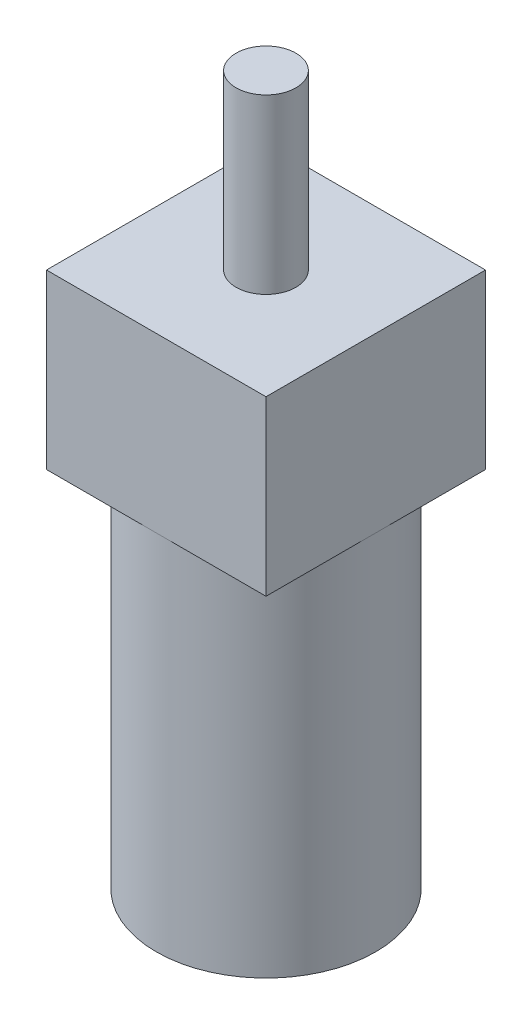
ISO-10303-21;
HEADER;
FILE_DESCRIPTION(('STEP AP214'),'2;1');
FILE_NAME('part.step','',(''),(''),'','','');
FILE_SCHEMA(('AUTOMOTIVE_DESIGN { 1 0 10303 214 1 1 1 1 }'));
ENDSEC;
DATA;
#1=APPLICATION_CONTEXT('core data for automotive mechanical design processes');
#2=APPLICATION_PROTOCOL_DEFINITION('international standard','automotive_design',2000,#1);
#3=PRODUCT_CONTEXT('',#1,'mechanical');
#4=PRODUCT('Part','Part','',(#3));
#5=PRODUCT_RELATED_PRODUCT_CATEGORY('part','',(#4));
#6=PRODUCT_DEFINITION_FORMATION('','',#4);
#7=PRODUCT_DEFINITION_CONTEXT('part definition',#1,'design');
#8=PRODUCT_DEFINITION('design','',#6,#7);
#9=PRODUCT_DEFINITION_SHAPE('','',#8);
#10=(LENGTH_UNIT() NAMED_UNIT(*) SI_UNIT(.MILLI.,.METRE.));
#11=(NAMED_UNIT(*) PLANE_ANGLE_UNIT() SI_UNIT($,.RADIAN.));
#12=(NAMED_UNIT(*) SI_UNIT($,.STERADIAN.) SOLID_ANGLE_UNIT());
#13=UNCERTAINTY_MEASURE_WITH_UNIT(LENGTH_MEASURE(1.E-05),#10,'distance_accuracy_value','');
#14=(GEOMETRIC_REPRESENTATION_CONTEXT(3) GLOBAL_UNCERTAINTY_ASSIGNED_CONTEXT((#13)) GLOBAL_UNIT_ASSIGNED_CONTEXT((#10,
#11,#12)) REPRESENTATION_CONTEXT('',''));
#15=CARTESIAN_POINT('',(0.,0.,0.));
#16=DIRECTION('',(0.,0.,1.));
#17=DIRECTION('',(1.,0.,0.));
#18=AXIS2_PLACEMENT_3D('',#15,#16,#17);
#19=CARTESIAN_POINT('',(0.,10.,0.));
#20=DIRECTION('',(0.,1.,0.));
#21=DIRECTION('',(-1.,0.,0.));
#22=AXIS2_PLACEMENT_3D('',#19,#20,#21);
#23=CYLINDRICAL_SURFACE('',#22,6.05);
#24=CARTESIAN_POINT('',(0.,-10.,0.));
#25=DIRECTION('',(0.,1.,0.));
#26=DIRECTION('',(-1.,0.,0.));
#27=AXIS2_PLACEMENT_3D('',#24,#25,#26);
#28=CIRCLE('',#27,6.05);
#29=CARTESIAN_POINT('',(-6.05,-10.,0.));
#30=VERTEX_POINT('',#29);
#31=EDGE_CURVE('E11',#30,#30,#28,.T.);
#32=ORIENTED_EDGE('',*,*,#31,.T.);
#33=EDGE_LOOP('',(#32));
#34=FACE_BOUND('',#33,.T.);
#35=CARTESIAN_POINT('',(0.,10.,0.));
#36=DIRECTION('',(0.,1.,0.));
#37=DIRECTION('',(-1.,0.,0.));
#38=AXIS2_PLACEMENT_3D('',#35,#36,#37);
#39=CIRCLE('',#38,6.05);
#40=CARTESIAN_POINT('',(-6.05,10.,0.));
#41=VERTEX_POINT('',#40);
#42=CARTESIAN_POINT('',(0.,10.,6.05));
#43=VERTEX_POINT('',#42);
#44=EDGE_CURVE('E42',#41,#43,#39,.T.);
#45=ORIENTED_EDGE('',*,*,#44,.F.);
#46=CARTESIAN_POINT('',(0.,10.,-6.05));
#47=VERTEX_POINT('',#46);
#48=EDGE_CURVE('E49',#47,#41,#39,.T.);
#49=ORIENTED_EDGE('',*,*,#48,.F.);
#50=CARTESIAN_POINT('',(6.04999999999999,10.,0.));
#51=VERTEX_POINT('',#50);
#52=EDGE_CURVE('E53',#51,#47,#39,.T.);
#53=ORIENTED_EDGE('',*,*,#52,.F.);
#54=EDGE_CURVE('E117',#43,#51,#39,.T.);
#55=ORIENTED_EDGE('',*,*,#54,.F.);
#56=EDGE_LOOP('',(#45,#49,#53,#55));
#57=FACE_BOUND('',#56,.T.);
#58=ADVANCED_FACE('F35',(#34,#57),#23,.T.);
#59=CARTESIAN_POINT('',(-6.05,-10.,0.));
#60=DIRECTION('',(0.,-1.,0.));
#61=DIRECTION('',(1.,0.,0.));
#62=AXIS2_PLACEMENT_3D('',#59,#60,#61);
#63=PLANE('',#62);
#64=ORIENTED_EDGE('',*,*,#31,.F.);
#65=EDGE_LOOP('',(#64));
#66=FACE_BOUND('',#65,.T.);
#67=ADVANCED_FACE('F160',(#66),#63,.T.);
#68=CARTESIAN_POINT('',(0.,10.,0.));
#69=DIRECTION('',(0.,1.,0.));
#70=DIRECTION('',(-1.,0.,0.));
#71=AXIS2_PLACEMENT_3D('',#68,#69,#70);
#72=PLANE('',#71);
#73=DIRECTION('',(0.,0.,1.));
#74=VECTOR('',#73,1.);
#75=CARTESIAN_POINT('',(-6.05,10.,6.05));
#76=LINE('',#75,#74);
#77=CARTESIAN_POINT('',(-6.05,10.,6.05));
#78=VERTEX_POINT('',#77);
#79=EDGE_CURVE('E110',#41,#78,#76,.T.);
#80=ORIENTED_EDGE('',*,*,#79,.F.);
#81=ORIENTED_EDGE('',*,*,#44,.T.);
#82=DIRECTION('',(1.,0.,0.));
#83=VECTOR('',#82,1.);
#84=CARTESIAN_POINT('',(6.04999999999999,10.,6.05));
#85=LINE('',#84,#83);
#86=EDGE_CURVE('E149',#78,#43,#85,.T.);
#87=ORIENTED_EDGE('',*,*,#86,.F.);
#88=EDGE_LOOP('',(#80,#81,#87));
#89=FACE_BOUND('',#88,.T.);
#90=ADVANCED_FACE('F154',(#89),#72,.F.);
#91=CARTESIAN_POINT('',(6.04999999999999,10.,6.05));
#92=VERTEX_POINT('',#91);
#93=EDGE_CURVE('E148',#43,#92,#85,.T.);
#94=ORIENTED_EDGE('',*,*,#93,.F.);
#95=ORIENTED_EDGE('',*,*,#54,.T.);
#96=DIRECTION('',(0.,0.,-1.));
#97=VECTOR('',#96,1.);
#98=CARTESIAN_POINT('',(6.04999999999999,10.,6.05));
#99=LINE('',#98,#97);
#100=EDGE_CURVE('E136',#92,#51,#99,.T.);
#101=ORIENTED_EDGE('',*,*,#100,.F.);
#102=EDGE_LOOP('',(#94,#95,#101));
#103=FACE_BOUND('',#102,.T.);
#104=ADVANCED_FACE('F152',(#103),#72,.F.);
#105=CARTESIAN_POINT('',(6.04999999999999,10.,-6.05));
#106=VERTEX_POINT('',#105);
#107=EDGE_CURVE('E128',#51,#106,#99,.T.);
#108=ORIENTED_EDGE('',*,*,#107,.F.);
#109=ORIENTED_EDGE('',*,*,#52,.T.);
#110=DIRECTION('',(-1.,0.,0.));
#111=VECTOR('',#110,1.);
#112=CARTESIAN_POINT('',(6.04999999999999,10.,-6.05));
#113=LINE('',#112,#111);
#114=EDGE_CURVE('E105',#106,#47,#113,.T.);
#115=ORIENTED_EDGE('',*,*,#114,.F.);
#116=EDGE_LOOP('',(#108,#109,#115));
#117=FACE_BOUND('',#116,.T.);
#118=ADVANCED_FACE('F126',(#117),#72,.F.);
#119=CARTESIAN_POINT('',(-6.05,10.,-6.05));
#120=VERTEX_POINT('',#119);
#121=EDGE_CURVE('E132',#47,#120,#113,.T.);
#122=ORIENTED_EDGE('',*,*,#121,.F.);
#123=ORIENTED_EDGE('',*,*,#48,.T.);
#124=EDGE_CURVE('E134',#120,#41,#76,.T.);
#125=ORIENTED_EDGE('',*,*,#124,.F.);
#126=EDGE_LOOP('',(#122,#123,#125));
#127=FACE_BOUND('',#126,.T.);
#128=ADVANCED_FACE('F133',(#127),#72,.F.);
#129=CARTESIAN_POINT('',(-6.05,19.525,6.05));
#130=DIRECTION('',(1.,0.,0.));
#131=DIRECTION('',(0.,1.,0.));
#132=AXIS2_PLACEMENT_3D('',#129,#130,#131);
#133=PLANE('',#132);
#134=ORIENTED_EDGE('',*,*,#124,.T.);
#135=ORIENTED_EDGE('',*,*,#79,.T.);
#136=DIRECTION('',(0.,-1.,0.));
#137=VECTOR('',#136,1.);
#138=CARTESIAN_POINT('',(-6.05,19.525,6.05));
#139=LINE('',#138,#137);
#140=CARTESIAN_POINT('',(-6.05,19.525,6.05));
#141=VERTEX_POINT('',#140);
#142=EDGE_CURVE('E90',#141,#78,#139,.T.);
#143=ORIENTED_EDGE('',*,*,#142,.F.);
#144=DIRECTION('',(0.,0.,1.));
#145=VECTOR('',#144,1.);
#146=CARTESIAN_POINT('',(-6.05,19.525,6.05));
#147=LINE('',#146,#145);
#148=CARTESIAN_POINT('',(-6.05,19.525,-6.05));
#149=VERTEX_POINT('',#148);
#150=EDGE_CURVE('E96',#149,#141,#147,.T.);
#151=ORIENTED_EDGE('',*,*,#150,.F.);
#152=DIRECTION('',(0.,-1.,0.));
#153=VECTOR('',#152,1.);
#154=CARTESIAN_POINT('',(-6.05,19.525,-6.05));
#155=LINE('',#154,#153);
#156=EDGE_CURVE('E144',#149,#120,#155,.T.);
#157=ORIENTED_EDGE('',*,*,#156,.T.);
#158=EDGE_LOOP('',(#134,#135,#143,#151,#157));
#159=FACE_BOUND('',#158,.T.);
#160=ADVANCED_FACE('F108',(#159),#133,.F.);
#161=CARTESIAN_POINT('',(6.04999999999999,19.525,6.05));
#162=DIRECTION('',(0.,0.,-1.));
#163=DIRECTION('',(-1.,0.,0.));
#164=AXIS2_PLACEMENT_3D('',#161,#162,#163);
#165=PLANE('',#164);
#166=ORIENTED_EDGE('',*,*,#86,.T.);
#167=ORIENTED_EDGE('',*,*,#93,.T.);
#168=DIRECTION('',(0.,-1.,0.));
#169=VECTOR('',#168,1.);
#170=CARTESIAN_POINT('',(6.04999999999999,19.525,6.05));
#171=LINE('',#170,#169);
#172=CARTESIAN_POINT('',(6.04999999999999,19.525,6.05));
#173=VERTEX_POINT('',#172);
#174=EDGE_CURVE('E92',#173,#92,#171,.T.);
#175=ORIENTED_EDGE('',*,*,#174,.F.);
#176=DIRECTION('',(1.,0.,0.));
#177=VECTOR('',#176,1.);
#178=CARTESIAN_POINT('',(6.04999999999999,19.525,6.05));
#179=LINE('',#178,#177);
#180=EDGE_CURVE('E85',#141,#173,#179,.T.);
#181=ORIENTED_EDGE('',*,*,#180,.F.);
#182=ORIENTED_EDGE('',*,*,#142,.T.);
#183=EDGE_LOOP('',(#166,#167,#175,#181,#182));
#184=FACE_BOUND('',#183,.T.);
#185=ADVANCED_FACE('F88',(#184),#165,.F.);
#186=CARTESIAN_POINT('',(6.04999999999999,19.525,6.05));
#187=DIRECTION('',(-1.,0.,0.));
#188=DIRECTION('',(0.,-1.,0.));
#189=AXIS2_PLACEMENT_3D('',#186,#187,#188);
#190=PLANE('',#189);
#191=ORIENTED_EDGE('',*,*,#100,.T.);
#192=ORIENTED_EDGE('',*,*,#107,.T.);
#193=DIRECTION('',(0.,-1.,0.));
#194=VECTOR('',#193,1.);
#195=CARTESIAN_POINT('',(6.04999999999999,19.525,-6.05));
#196=LINE('',#195,#194);
#197=CARTESIAN_POINT('',(6.04999999999999,19.525,-6.05));
#198=VERTEX_POINT('',#197);
#199=EDGE_CURVE('E113',#198,#106,#196,.T.);
#200=ORIENTED_EDGE('',*,*,#199,.F.);
#201=DIRECTION('',(0.,0.,-1.));
#202=VECTOR('',#201,1.);
#203=CARTESIAN_POINT('',(6.04999999999999,19.525,6.05));
#204=LINE('',#203,#202);
#205=EDGE_CURVE('E95',#173,#198,#204,.T.);
#206=ORIENTED_EDGE('',*,*,#205,.F.);
#207=ORIENTED_EDGE('',*,*,#174,.T.);
#208=EDGE_LOOP('',(#191,#192,#200,#206,#207));
#209=FACE_BOUND('',#208,.T.);
#210=ADVANCED_FACE('F151',(#209),#190,.F.);
#211=CARTESIAN_POINT('',(6.04999999999999,19.525,-6.05));
#212=DIRECTION('',(0.,0.,1.));
#213=DIRECTION('',(1.,0.,0.));
#214=AXIS2_PLACEMENT_3D('',#211,#212,#213);
#215=PLANE('',#214);
#216=ORIENTED_EDGE('',*,*,#114,.T.);
#217=ORIENTED_EDGE('',*,*,#121,.T.);
#218=ORIENTED_EDGE('',*,*,#156,.F.);
#219=DIRECTION('',(-1.,0.,0.));
#220=VECTOR('',#219,1.);
#221=CARTESIAN_POINT('',(6.04999999999999,19.525,-6.05));
#222=LINE('',#221,#220);
#223=EDGE_CURVE('E101',#198,#149,#222,.T.);
#224=ORIENTED_EDGE('',*,*,#223,.F.);
#225=ORIENTED_EDGE('',*,*,#199,.T.);
#226=EDGE_LOOP('',(#216,#217,#218,#224,#225));
#227=FACE_BOUND('',#226,.T.);
#228=ADVANCED_FACE('F139',(#227),#215,.F.);
#229=CARTESIAN_POINT('',(0.,19.525,0.));
#230=DIRECTION('',(0.,1.,0.));
#231=DIRECTION('',(-1.,0.,0.));
#232=AXIS2_PLACEMENT_3D('',#229,#230,#231);
#233=PLANE('',#232);
#234=CARTESIAN_POINT('',(0.,19.525,0.));
#235=DIRECTION('',(0.,1.,0.));
#236=DIRECTION('',(-1.,0.,0.));
#237=AXIS2_PLACEMENT_3D('',#234,#235,#236);
#238=CIRCLE('',#237,1.65292218577839);
#239=CARTESIAN_POINT('',(-1.65292218577839,19.525,0.));
#240=VERTEX_POINT('',#239);
#241=EDGE_CURVE('E199',#240,#240,#238,.T.);
#242=ORIENTED_EDGE('',*,*,#241,.F.);
#243=EDGE_LOOP('',(#242));
#244=FACE_BOUND('',#243,.T.);
#245=ORIENTED_EDGE('',*,*,#150,.T.);
#246=ORIENTED_EDGE('',*,*,#180,.T.);
#247=ORIENTED_EDGE('',*,*,#205,.T.);
#248=ORIENTED_EDGE('',*,*,#223,.T.);
#249=EDGE_LOOP('',(#245,#246,#247,#248));
#250=FACE_BOUND('',#249,.T.);
#251=ADVANCED_FACE('F99',(#244,#250),#233,.T.);
#252=CARTESIAN_POINT('',(0.,29.05,0.));
#253=DIRECTION('',(0.,-1.,0.));
#254=DIRECTION('',(1.,0.,0.));
#255=AXIS2_PLACEMENT_3D('',#252,#253,#254);
#256=CYLINDRICAL_SURFACE('',#255,1.65292218577839);
#257=CARTESIAN_POINT('',(0.,29.05,0.));
#258=DIRECTION('',(0.,1.,0.));
#259=DIRECTION('',(-1.,0.,0.));
#260=AXIS2_PLACEMENT_3D('',#257,#258,#259);
#261=CIRCLE('',#260,1.65292218577839);
#262=CARTESIAN_POINT('',(-1.65292218577839,29.05,0.));
#263=VERTEX_POINT('',#262);
#264=EDGE_CURVE('E198',#263,#263,#261,.T.);
#265=ORIENTED_EDGE('',*,*,#264,.F.);
#266=EDGE_LOOP('',(#265));
#267=FACE_BOUND('',#266,.T.);
#268=ORIENTED_EDGE('',*,*,#241,.T.);
#269=EDGE_LOOP('',(#268));
#270=FACE_BOUND('',#269,.T.);
#271=ADVANCED_FACE('F182',(#267,#270),#256,.T.);
#272=CARTESIAN_POINT('',(0.,29.05,0.));
#273=DIRECTION('',(0.,1.,0.));
#274=DIRECTION('',(-1.,0.,0.));
#275=AXIS2_PLACEMENT_3D('',#272,#273,#274);
#276=PLANE('',#275);
#277=ORIENTED_EDGE('',*,*,#264,.T.);
#278=EDGE_LOOP('',(#277));
#279=FACE_BOUND('',#278,.T.);
#280=ADVANCED_FACE('F187',(#279),#276,.T.);
#281=CLOSED_SHELL('',(#58,#67,#90,#104,#118,#128,#160,#185,#210,#228,#251,#271,#280));
#282=MANIFOLD_SOLID_BREP('B2',#281);
#283=ADVANCED_BREP_SHAPE_REPRESENTATION('',(#18,#282),#14);
#284=SHAPE_DEFINITION_REPRESENTATION(#9,#283);
ENDSEC;
END-ISO-10303-21;
